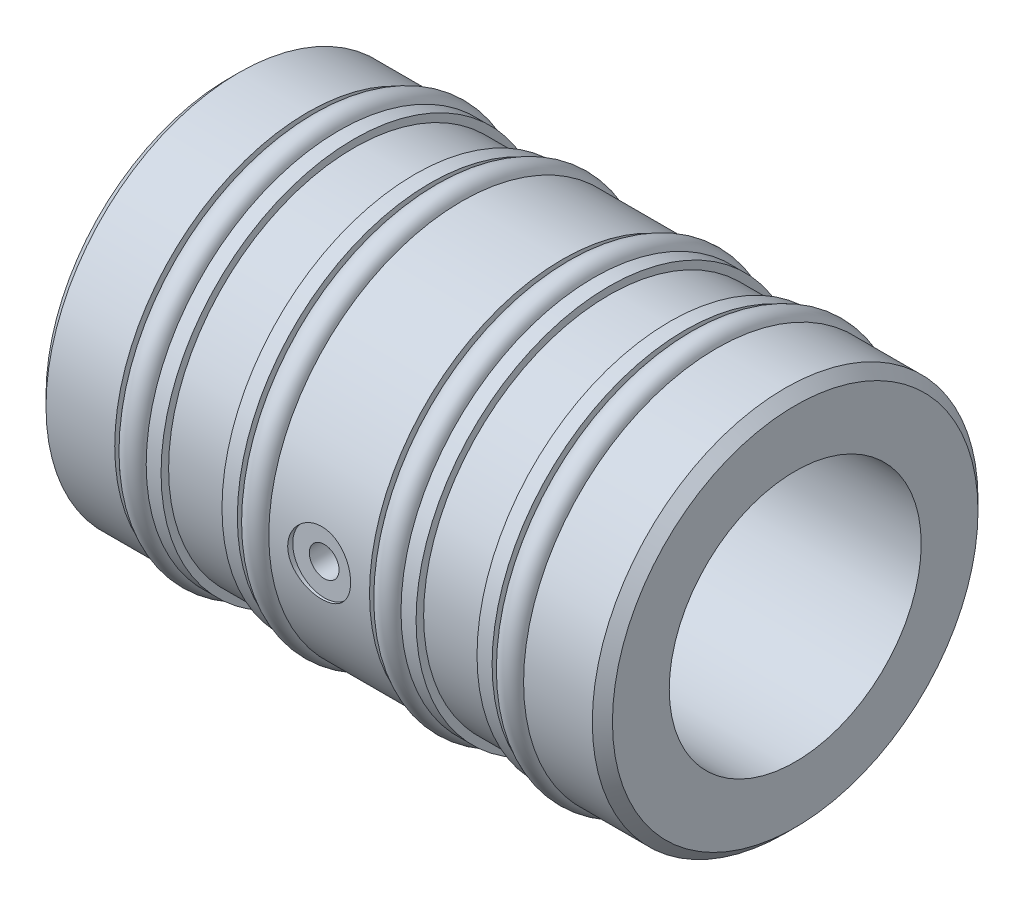
ISO-10303-21;
HEADER;
FILE_DESCRIPTION(('STEP AP214'),'2;1');
FILE_NAME('part.step','',(''),(''),'','','');
FILE_SCHEMA(('AUTOMOTIVE_DESIGN { 1 0 10303 214 1 1 1 1 }'));
ENDSEC;
DATA;
#1=APPLICATION_CONTEXT('core data for automotive mechanical design processes');
#2=APPLICATION_PROTOCOL_DEFINITION('international standard','automotive_design',2000,#1);
#3=PRODUCT_CONTEXT('',#1,'mechanical');
#4=PRODUCT('Part','Part','',(#3));
#5=PRODUCT_RELATED_PRODUCT_CATEGORY('part','',(#4));
#6=PRODUCT_DEFINITION_FORMATION('','',#4);
#7=PRODUCT_DEFINITION_CONTEXT('part definition',#1,'design');
#8=PRODUCT_DEFINITION('design','',#6,#7);
#9=PRODUCT_DEFINITION_SHAPE('','',#8);
#10=(LENGTH_UNIT() NAMED_UNIT(*) SI_UNIT(.MILLI.,.METRE.));
#11=(NAMED_UNIT(*) PLANE_ANGLE_UNIT() SI_UNIT($,.RADIAN.));
#12=(NAMED_UNIT(*) SI_UNIT($,.STERADIAN.) SOLID_ANGLE_UNIT());
#13=UNCERTAINTY_MEASURE_WITH_UNIT(LENGTH_MEASURE(1.E-05),#10,'distance_accuracy_value','');
#14=(GEOMETRIC_REPRESENTATION_CONTEXT(3) GLOBAL_UNCERTAINTY_ASSIGNED_CONTEXT((#13)) GLOBAL_UNIT_ASSIGNED_CONTEXT((#10,
#11,#12)) REPRESENTATION_CONTEXT('',''));
#15=CARTESIAN_POINT('',(0.,0.,0.));
#16=DIRECTION('',(0.,0.,1.));
#17=DIRECTION('',(1.,0.,0.));
#18=AXIS2_PLACEMENT_3D('',#15,#16,#17);
#19=CARTESIAN_POINT('',(0.,0.,0.));
#20=DIRECTION('',(-1.,0.,0.));
#21=DIRECTION('',(0.,0.,1.));
#22=AXIS2_PLACEMENT_3D('',#19,#20,#21);
#23=CYLINDRICAL_SURFACE('',#22,17.4752);
#24=CARTESIAN_POINT('',(46.0248,0.,0.));
#25=DIRECTION('',(-1.,0.,0.));
#26=DIRECTION('',(0.,0.,1.));
#27=AXIS2_PLACEMENT_3D('',#24,#25,#26);
#28=CIRCLE('',#27,17.4752);
#29=CARTESIAN_POINT('',(46.0248,0.,17.4752));
#30=VERTEX_POINT('',#29);
#31=EDGE_CURVE('E320',#30,#30,#28,.T.);
#32=ORIENTED_EDGE('',*,*,#31,.F.);
#33=EDGE_LOOP('',(#32));
#34=FACE_BOUND('',#33,.T.);
#35=CARTESIAN_POINT('',(47.5310200000001,0.,0.));
#36=DIRECTION('',(1.,0.,0.));
#37=DIRECTION('',(0.,0.,-1.));
#38=AXIS2_PLACEMENT_3D('',#35,#36,#37);
#39=CIRCLE('',#38,17.4752);
#40=CARTESIAN_POINT('',(47.5310200000001,0.,-17.4752));
#41=VERTEX_POINT('',#40);
#42=EDGE_CURVE('E14',#41,#41,#39,.T.);
#43=ORIENTED_EDGE('',*,*,#42,.F.);
#44=EDGE_LOOP('',(#43));
#45=FACE_BOUND('',#44,.T.);
#46=ADVANCED_FACE('F48',(#34,#45),#23,.T.);
#47=CARTESIAN_POINT('',(49.1998,0.,0.));
#48=DIRECTION('',(-1.,0.,0.));
#49=DIRECTION('',(0.,0.,1.));
#50=AXIS2_PLACEMENT_3D('',#47,#48,#49);
#51=CIRCLE('',#50,17.4752);
#52=CARTESIAN_POINT('',(49.1998,0.,17.4752));
#53=VERTEX_POINT('',#52);
#54=EDGE_CURVE('E319',#53,#53,#51,.T.);
#55=ORIENTED_EDGE('',*,*,#54,.T.);
#56=EDGE_LOOP('',(#55));
#57=FACE_BOUND('',#56,.T.);
#58=CARTESIAN_POINT('',(47.6935799999999,0.,0.));
#59=DIRECTION('',(-1.,0.,0.));
#60=DIRECTION('',(0.,0.,1.));
#61=AXIS2_PLACEMENT_3D('',#58,#59,#60);
#62=CIRCLE('',#61,17.4752);
#63=CARTESIAN_POINT('',(47.6935799999999,0.,17.4752));
#64=VERTEX_POINT('',#63);
#65=EDGE_CURVE('E56',#64,#64,#62,.T.);
#66=ORIENTED_EDGE('',*,*,#65,.F.);
#67=EDGE_LOOP('',(#66));
#68=FACE_BOUND('',#67,.T.);
#69=ADVANCED_FACE('F117',(#57,#68),#23,.T.);
#70=CARTESIAN_POINT('',(0.,0.,0.));
#71=DIRECTION('',(-1.,0.,0.));
#72=DIRECTION('',(0.,0.,1.));
#73=AXIS2_PLACEMENT_3D('',#70,#71,#72);
#74=CYLINDRICAL_SURFACE('',#73,17.4752);
#75=CARTESIAN_POINT('',(33.655,0.,0.));
#76=DIRECTION('',(-1.,0.,0.));
#77=DIRECTION('',(0.,0.,1.));
#78=AXIS2_PLACEMENT_3D('',#75,#76,#77);
#79=CIRCLE('',#78,17.4752);
#80=CARTESIAN_POINT('',(33.655,0.,17.4752));
#81=VERTEX_POINT('',#80);
#82=EDGE_CURVE('E163',#81,#81,#79,.T.);
#83=ORIENTED_EDGE('',*,*,#82,.F.);
#84=EDGE_LOOP('',(#83));
#85=FACE_BOUND('',#84,.T.);
#86=CARTESIAN_POINT('',(35.1612200000001,0.,0.));
#87=DIRECTION('',(1.,0.,0.));
#88=DIRECTION('',(0.,0.,-1.));
#89=AXIS2_PLACEMENT_3D('',#86,#87,#88);
#90=CIRCLE('',#89,17.4752);
#91=CARTESIAN_POINT('',(35.1612200000001,0.,-17.4752));
#92=VERTEX_POINT('',#91);
#93=EDGE_CURVE('E305',#92,#92,#90,.T.);
#94=ORIENTED_EDGE('',*,*,#93,.F.);
#95=EDGE_LOOP('',(#94));
#96=FACE_BOUND('',#95,.T.);
#97=ADVANCED_FACE('F147',(#85,#96),#74,.T.);
#98=CARTESIAN_POINT('',(36.83,0.,0.));
#99=DIRECTION('',(-1.,0.,0.));
#100=DIRECTION('',(0.,0.,1.));
#101=AXIS2_PLACEMENT_3D('',#98,#99,#100);
#102=CIRCLE('',#101,17.4752);
#103=CARTESIAN_POINT('',(36.83,0.,17.4752));
#104=VERTEX_POINT('',#103);
#105=EDGE_CURVE('E164',#104,#104,#102,.T.);
#106=ORIENTED_EDGE('',*,*,#105,.T.);
#107=EDGE_LOOP('',(#106));
#108=FACE_BOUND('',#107,.T.);
#109=CARTESIAN_POINT('',(35.3237799999999,0.,0.));
#110=DIRECTION('',(-1.,0.,0.));
#111=DIRECTION('',(0.,0.,1.));
#112=AXIS2_PLACEMENT_3D('',#109,#110,#111);
#113=CIRCLE('',#112,17.4752);
#114=CARTESIAN_POINT('',(35.3237799999999,0.,17.4752));
#115=VERTEX_POINT('',#114);
#116=EDGE_CURVE('E298',#115,#115,#113,.T.);
#117=ORIENTED_EDGE('',*,*,#116,.F.);
#118=EDGE_LOOP('',(#117));
#119=FACE_BOUND('',#118,.T.);
#120=ADVANCED_FACE('F149',(#108,#119),#74,.T.);
#121=CARTESIAN_POINT('',(0.,0.,0.));
#122=DIRECTION('',(-1.,0.,0.));
#123=DIRECTION('',(0.,0.,1.));
#124=AXIS2_PLACEMENT_3D('',#121,#122,#123);
#125=CYLINDRICAL_SURFACE('',#124,17.4752);
#126=CARTESIAN_POINT('',(20.32,0.,0.));
#127=DIRECTION('',(-1.,0.,0.));
#128=DIRECTION('',(0.,0.,1.));
#129=AXIS2_PLACEMENT_3D('',#126,#127,#128);
#130=CIRCLE('',#129,17.4752);
#131=CARTESIAN_POINT('',(20.32,0.,17.4752));
#132=VERTEX_POINT('',#131);
#133=EDGE_CURVE('E178',#132,#132,#130,.T.);
#134=ORIENTED_EDGE('',*,*,#133,.F.);
#135=EDGE_LOOP('',(#134));
#136=FACE_BOUND('',#135,.T.);
#137=CARTESIAN_POINT('',(21.8262200000001,0.,0.));
#138=DIRECTION('',(1.,0.,0.));
#139=DIRECTION('',(0.,0.,-1.));
#140=AXIS2_PLACEMENT_3D('',#137,#138,#139);
#141=CIRCLE('',#140,17.4752);
#142=CARTESIAN_POINT('',(21.8262200000001,0.,-17.4752));
#143=VERTEX_POINT('',#142);
#144=EDGE_CURVE('E295',#143,#143,#141,.T.);
#145=ORIENTED_EDGE('',*,*,#144,.F.);
#146=EDGE_LOOP('',(#145));
#147=FACE_BOUND('',#146,.T.);
#148=ADVANCED_FACE('F277',(#136,#147),#125,.T.);
#149=CARTESIAN_POINT('',(23.495,0.,0.));
#150=DIRECTION('',(-1.,0.,0.));
#151=DIRECTION('',(0.,0.,1.));
#152=AXIS2_PLACEMENT_3D('',#149,#150,#151);
#153=CIRCLE('',#152,17.4752);
#154=CARTESIAN_POINT('',(23.495,0.,17.4752));
#155=VERTEX_POINT('',#154);
#156=EDGE_CURVE('E175',#155,#155,#153,.T.);
#157=ORIENTED_EDGE('',*,*,#156,.T.);
#158=EDGE_LOOP('',(#157));
#159=FACE_BOUND('',#158,.T.);
#160=CARTESIAN_POINT('',(21.9887799999999,0.,0.));
#161=DIRECTION('',(-1.,0.,0.));
#162=DIRECTION('',(0.,0.,1.));
#163=AXIS2_PLACEMENT_3D('',#160,#161,#162);
#164=CIRCLE('',#163,17.4752);
#165=CARTESIAN_POINT('',(21.9887799999999,0.,17.4752));
#166=VERTEX_POINT('',#165);
#167=EDGE_CURVE('E293',#166,#166,#164,.T.);
#168=ORIENTED_EDGE('',*,*,#167,.F.);
#169=EDGE_LOOP('',(#168));
#170=FACE_BOUND('',#169,.T.);
#171=ADVANCED_FACE('F248',(#159,#170),#125,.T.);
#172=CARTESIAN_POINT('',(0.,0.,0.));
#173=DIRECTION('',(-1.,0.,0.));
#174=DIRECTION('',(0.,0.,1.));
#175=AXIS2_PLACEMENT_3D('',#172,#173,#174);
#176=CYLINDRICAL_SURFACE('',#175,17.4752);
#177=CARTESIAN_POINT('',(7.9502,0.,0.));
#178=DIRECTION('',(-1.,0.,0.));
#179=DIRECTION('',(0.,0.,1.));
#180=AXIS2_PLACEMENT_3D('',#177,#178,#179);
#181=CIRCLE('',#180,17.4752);
#182=CARTESIAN_POINT('',(7.9502,0.,17.4752));
#183=VERTEX_POINT('',#182);
#184=EDGE_CURVE('E202',#183,#183,#181,.T.);
#185=ORIENTED_EDGE('',*,*,#184,.F.);
#186=EDGE_LOOP('',(#185));
#187=FACE_BOUND('',#186,.T.);
#188=CARTESIAN_POINT('',(9.45642000000007,0.,0.));
#189=DIRECTION('',(1.,0.,0.));
#190=DIRECTION('',(0.,0.,-1.));
#191=AXIS2_PLACEMENT_3D('',#188,#189,#190);
#192=CIRCLE('',#191,17.4752);
#193=CARTESIAN_POINT('',(9.45642000000007,0.,-17.4752));
#194=VERTEX_POINT('',#193);
#195=EDGE_CURVE('E73',#194,#194,#192,.T.);
#196=ORIENTED_EDGE('',*,*,#195,.F.);
#197=EDGE_LOOP('',(#196));
#198=FACE_BOUND('',#197,.T.);
#199=ADVANCED_FACE('F245',(#187,#198),#176,.T.);
#200=CARTESIAN_POINT('',(11.1252,0.,0.));
#201=DIRECTION('',(-1.,0.,0.));
#202=DIRECTION('',(0.,0.,1.));
#203=AXIS2_PLACEMENT_3D('',#200,#201,#202);
#204=CIRCLE('',#203,17.4752);
#205=CARTESIAN_POINT('',(11.1252,0.,17.4752));
#206=VERTEX_POINT('',#205);
#207=EDGE_CURVE('E199',#206,#206,#204,.T.);
#208=ORIENTED_EDGE('',*,*,#207,.T.);
#209=EDGE_LOOP('',(#208));
#210=FACE_BOUND('',#209,.T.);
#211=CARTESIAN_POINT('',(9.61897999999994,0.,0.));
#212=DIRECTION('',(-1.,0.,0.));
#213=DIRECTION('',(0.,0.,1.));
#214=AXIS2_PLACEMENT_3D('',#211,#212,#213);
#215=CIRCLE('',#214,17.4752);
#216=CARTESIAN_POINT('',(9.61897999999994,0.,17.4752));
#217=VERTEX_POINT('',#216);
#218=EDGE_CURVE('E71',#217,#217,#215,.T.);
#219=ORIENTED_EDGE('',*,*,#218,.F.);
#220=EDGE_LOOP('',(#219));
#221=FACE_BOUND('',#220,.T.);
#222=ADVANCED_FACE('F235',(#210,#221),#176,.T.);
#223=CARTESIAN_POINT('',(0.,12.71016,0.));
#224=DIRECTION('',(1.,0.,0.));
#225=DIRECTION('',(0.,0.,-1.));
#226=AXIS2_PLACEMENT_3D('',#223,#224,#225);
#227=PLANE('',#226);
#228=CARTESIAN_POINT('',(0.,0.,0.));
#229=DIRECTION('',(1.,0.,0.));
#230=DIRECTION('',(0.,0.,-1.));
#231=AXIS2_PLACEMENT_3D('',#228,#229,#230);
#232=CIRCLE('',#231,18.4404);
#233=CARTESIAN_POINT('',(0.,0.,-18.4404));
#234=VERTEX_POINT('',#233);
#235=EDGE_CURVE('E208',#234,#234,#232,.F.);
#236=ORIENTED_EDGE('',*,*,#235,.T.);
#237=EDGE_LOOP('',(#236));
#238=FACE_BOUND('',#237,.T.);
#239=CARTESIAN_POINT('',(0.,0.,0.));
#240=DIRECTION('',(-1.,0.,0.));
#241=DIRECTION('',(0.,0.,1.));
#242=AXIS2_PLACEMENT_3D('',#239,#240,#241);
#243=CIRCLE('',#242,12.71016);
#244=CARTESIAN_POINT('',(0.,0.,12.71016));
#245=VERTEX_POINT('',#244);
#246=EDGE_CURVE('E406',#245,#245,#243,.T.);
#247=ORIENTED_EDGE('',*,*,#246,.F.);
#248=EDGE_LOOP('',(#247));
#249=FACE_BOUND('',#248,.T.);
#250=ADVANCED_FACE('F231',(#238,#249),#227,.F.);
#251=CARTESIAN_POINT('',(0.,0.,0.));
#252=DIRECTION('',(-1.,0.,0.));
#253=DIRECTION('',(0.,0.,1.));
#254=AXIS2_PLACEMENT_3D('',#251,#252,#253);
#255=CYLINDRICAL_SURFACE('',#254,19.4564);
#256=CARTESIAN_POINT('',(1.01600000000001,0.,0.));
#257=DIRECTION('',(1.,0.,0.));
#258=DIRECTION('',(0.,0.,-1.));
#259=AXIS2_PLACEMENT_3D('',#256,#257,#258);
#260=CIRCLE('',#259,19.4564);
#261=CARTESIAN_POINT('',(1.01600000000001,0.,-19.4564));
#262=VERTEX_POINT('',#261);
#263=EDGE_CURVE('E211',#262,#262,#260,.T.);
#264=ORIENTED_EDGE('',*,*,#263,.T.);
#265=EDGE_LOOP('',(#264));
#266=FACE_BOUND('',#265,.T.);
#267=CARTESIAN_POINT('',(7.9502,0.,0.));
#268=DIRECTION('',(-1.,0.,0.));
#269=DIRECTION('',(0.,0.,1.));
#270=AXIS2_PLACEMENT_3D('',#267,#268,#269);
#271=CIRCLE('',#270,19.4564);
#272=CARTESIAN_POINT('',(7.9502,0.,19.4564));
#273=VERTEX_POINT('',#272);
#274=EDGE_CURVE('E205',#273,#273,#271,.T.);
#275=ORIENTED_EDGE('',*,*,#274,.T.);
#276=EDGE_LOOP('',(#275));
#277=FACE_BOUND('',#276,.T.);
#278=ADVANCED_FACE('F234',(#266,#277),#255,.T.);
#279=CARTESIAN_POINT('',(7.9502,19.4564,0.));
#280=DIRECTION('',(-1.,0.,0.));
#281=DIRECTION('',(0.,0.,1.));
#282=AXIS2_PLACEMENT_3D('',#279,#280,#281);
#283=PLANE('',#282);
#284=ORIENTED_EDGE('',*,*,#274,.F.);
#285=EDGE_LOOP('',(#284));
#286=FACE_BOUND('',#285,.T.);
#287=ORIENTED_EDGE('',*,*,#184,.T.);
#288=EDGE_LOOP('',(#287));
#289=FACE_BOUND('',#288,.T.);
#290=ADVANCED_FACE('F239',(#286,#289),#283,.F.);
#291=CARTESIAN_POINT('',(11.1252,17.4752,0.));
#292=DIRECTION('',(1.,0.,0.));
#293=DIRECTION('',(0.,0.,-1.));
#294=AXIS2_PLACEMENT_3D('',#291,#292,#293);
#295=PLANE('',#294);
#296=ORIENTED_EDGE('',*,*,#207,.F.);
#297=EDGE_LOOP('',(#296));
#298=FACE_BOUND('',#297,.T.);
#299=CARTESIAN_POINT('',(11.1252,0.,0.));
#300=DIRECTION('',(-1.,0.,0.));
#301=DIRECTION('',(0.,0.,1.));
#302=AXIS2_PLACEMENT_3D('',#299,#300,#301);
#303=CIRCLE('',#302,19.4564);
#304=CARTESIAN_POINT('',(11.1252,0.,19.4564));
#305=VERTEX_POINT('',#304);
#306=EDGE_CURVE('E196',#305,#305,#303,.T.);
#307=ORIENTED_EDGE('',*,*,#306,.T.);
#308=EDGE_LOOP('',(#307));
#309=FACE_BOUND('',#308,.T.);
#310=ADVANCED_FACE('F243',(#298,#309),#295,.F.);
#311=CARTESIAN_POINT('',(0.,0.,0.));
#312=DIRECTION('',(-1.,0.,0.));
#313=DIRECTION('',(0.,0.,1.));
#314=AXIS2_PLACEMENT_3D('',#311,#312,#313);
#315=CYLINDRICAL_SURFACE('',#314,19.4564);
#316=ORIENTED_EDGE('',*,*,#306,.F.);
#317=EDGE_LOOP('',(#316));
#318=FACE_BOUND('',#317,.T.);
#319=CARTESIAN_POINT('',(12.6238,0.,0.));
#320=DIRECTION('',(-1.,0.,0.));
#321=DIRECTION('',(0.,0.,1.));
#322=AXIS2_PLACEMENT_3D('',#319,#320,#321);
#323=CIRCLE('',#322,19.4564);
#324=CARTESIAN_POINT('',(12.6238,0.,19.4564));
#325=VERTEX_POINT('',#324);
#326=EDGE_CURVE('E193',#325,#325,#323,.T.);
#327=ORIENTED_EDGE('',*,*,#326,.T.);
#328=EDGE_LOOP('',(#327));
#329=FACE_BOUND('',#328,.T.);
#330=ADVANCED_FACE('F252',(#318,#329),#315,.T.);
#331=CARTESIAN_POINT('',(12.6238,19.4564,0.));
#332=DIRECTION('',(-1.,0.,0.));
#333=DIRECTION('',(0.,0.,1.));
#334=AXIS2_PLACEMENT_3D('',#331,#332,#333);
#335=PLANE('',#334);
#336=ORIENTED_EDGE('',*,*,#326,.F.);
#337=EDGE_LOOP('',(#336));
#338=FACE_BOUND('',#337,.T.);
#339=CARTESIAN_POINT('',(12.6238,0.,0.));
#340=DIRECTION('',(-1.,0.,0.));
#341=DIRECTION('',(0.,0.,1.));
#342=AXIS2_PLACEMENT_3D('',#339,#340,#341);
#343=CIRCLE('',#342,18.6944);
#344=CARTESIAN_POINT('',(12.6238,0.,18.6944));
#345=VERTEX_POINT('',#344);
#346=EDGE_CURVE('E190',#345,#345,#343,.T.);
#347=ORIENTED_EDGE('',*,*,#346,.T.);
#348=EDGE_LOOP('',(#347));
#349=FACE_BOUND('',#348,.T.);
#350=ADVANCED_FACE('F256',(#338,#349),#335,.F.);
#351=CARTESIAN_POINT('',(0.,0.,0.));
#352=DIRECTION('',(-1.,0.,0.));
#353=DIRECTION('',(0.,0.,1.));
#354=AXIS2_PLACEMENT_3D('',#351,#352,#353);
#355=CYLINDRICAL_SURFACE('',#354,18.6944);
#356=ORIENTED_EDGE('',*,*,#346,.F.);
#357=EDGE_LOOP('',(#356));
#358=FACE_BOUND('',#357,.T.);
#359=CARTESIAN_POINT('',(18.7706,0.,0.));
#360=DIRECTION('',(-1.,0.,0.));
#361=DIRECTION('',(0.,0.,1.));
#362=AXIS2_PLACEMENT_3D('',#359,#360,#361);
#363=CIRCLE('',#362,18.6944);
#364=CARTESIAN_POINT('',(18.7706,0.,18.6944));
#365=VERTEX_POINT('',#364);
#366=EDGE_CURVE('E187',#365,#365,#363,.T.);
#367=ORIENTED_EDGE('',*,*,#366,.T.);
#368=EDGE_LOOP('',(#367));
#369=FACE_BOUND('',#368,.T.);
#370=ADVANCED_FACE('F260',(#358,#369),#355,.T.);
#371=CARTESIAN_POINT('',(18.7706,18.6944,0.));
#372=DIRECTION('',(1.,0.,0.));
#373=DIRECTION('',(0.,0.,-1.));
#374=AXIS2_PLACEMENT_3D('',#371,#372,#373);
#375=PLANE('',#374);
#376=ORIENTED_EDGE('',*,*,#366,.F.);
#377=EDGE_LOOP('',(#376));
#378=FACE_BOUND('',#377,.T.);
#379=CARTESIAN_POINT('',(18.7706,0.,0.));
#380=DIRECTION('',(-1.,0.,0.));
#381=DIRECTION('',(0.,0.,1.));
#382=AXIS2_PLACEMENT_3D('',#379,#380,#381);
#383=CIRCLE('',#382,19.4564);
#384=CARTESIAN_POINT('',(18.7706,0.,19.4564));
#385=VERTEX_POINT('',#384);
#386=EDGE_CURVE('E184',#385,#385,#383,.T.);
#387=ORIENTED_EDGE('',*,*,#386,.T.);
#388=EDGE_LOOP('',(#387));
#389=FACE_BOUND('',#388,.T.);
#390=ADVANCED_FACE('F264',(#378,#389),#375,.F.);
#391=CARTESIAN_POINT('',(0.,0.,0.));
#392=DIRECTION('',(-1.,0.,0.));
#393=DIRECTION('',(0.,0.,1.));
#394=AXIS2_PLACEMENT_3D('',#391,#392,#393);
#395=CYLINDRICAL_SURFACE('',#394,19.4564);
#396=ORIENTED_EDGE('',*,*,#386,.F.);
#397=EDGE_LOOP('',(#396));
#398=FACE_BOUND('',#397,.T.);
#399=CARTESIAN_POINT('',(20.32,0.,0.));
#400=DIRECTION('',(-1.,0.,0.));
#401=DIRECTION('',(0.,0.,1.));
#402=AXIS2_PLACEMENT_3D('',#399,#400,#401);
#403=CIRCLE('',#402,19.4564);
#404=CARTESIAN_POINT('',(20.32,0.,19.4564));
#405=VERTEX_POINT('',#404);
#406=EDGE_CURVE('E181',#405,#405,#403,.T.);
#407=ORIENTED_EDGE('',*,*,#406,.T.);
#408=EDGE_LOOP('',(#407));
#409=FACE_BOUND('',#408,.T.);
#410=ADVANCED_FACE('F268',(#398,#409),#395,.T.);
#411=CARTESIAN_POINT('',(20.32,19.4564,0.));
#412=DIRECTION('',(-1.,0.,0.));
#413=DIRECTION('',(0.,0.,1.));
#414=AXIS2_PLACEMENT_3D('',#411,#412,#413);
#415=PLANE('',#414);
#416=ORIENTED_EDGE('',*,*,#406,.F.);
#417=EDGE_LOOP('',(#416));
#418=FACE_BOUND('',#417,.T.);
#419=ORIENTED_EDGE('',*,*,#133,.T.);
#420=EDGE_LOOP('',(#419));
#421=FACE_BOUND('',#420,.T.);
#422=ADVANCED_FACE('F272',(#418,#421),#415,.F.);
#423=CARTESIAN_POINT('',(23.495,17.4752,0.));
#424=DIRECTION('',(1.,0.,0.));
#425=DIRECTION('',(0.,0.,-1.));
#426=AXIS2_PLACEMENT_3D('',#423,#424,#425);
#427=PLANE('',#426);
#428=ORIENTED_EDGE('',*,*,#156,.F.);
#429=EDGE_LOOP('',(#428));
#430=FACE_BOUND('',#429,.T.);
#431=CARTESIAN_POINT('',(23.495,0.,0.));
#432=DIRECTION('',(-1.,0.,0.));
#433=DIRECTION('',(0.,0.,1.));
#434=AXIS2_PLACEMENT_3D('',#431,#432,#433);
#435=CIRCLE('',#434,19.4564);
#436=CARTESIAN_POINT('',(23.495,0.,19.4564));
#437=VERTEX_POINT('',#436);
#438=EDGE_CURVE('E166',#437,#437,#435,.T.);
#439=ORIENTED_EDGE('',*,*,#438,.T.);
#440=EDGE_LOOP('',(#439));
#441=FACE_BOUND('',#440,.T.);
#442=ADVANCED_FACE('F156',(#430,#441),#427,.F.);
#443=CARTESIAN_POINT('',(0.,0.,0.));
#444=DIRECTION('',(-1.,0.,0.));
#445=DIRECTION('',(0.,0.,1.));
#446=AXIS2_PLACEMENT_3D('',#443,#444,#445);
#447=CYLINDRICAL_SURFACE('',#446,19.4564);
#448=CARTESIAN_POINT('',(31.75,0.,19.4564));
#449=CARTESIAN_POINT('',(31.7499928533095,-0.177080248540076,19.4563970030519));
#450=CARTESIAN_POINT('',(31.7351354354906,-0.354258469943336,19.4539572708394));
#451=CARTESIAN_POINT('',(31.6761209289925,-0.703649286531011,19.4444596014055));
#452=CARTESIAN_POINT('',(31.6319365526539,-0.875857101067813,19.4373973631966));
#453=CARTESIAN_POINT('',(31.5156346637148,-1.21020127264191,19.4194471343395));
#454=CARTESIAN_POINT('',(31.4435396251569,-1.37234561135013,19.4085622224129));
#455=CARTESIAN_POINT('',(31.2735209364874,-1.68221437358157,19.3841647651429));
#456=CARTESIAN_POINT('',(31.1756003771481,-1.82994051976294,19.3706525342852));
#457=CARTESIAN_POINT('',(30.9557535689298,-2.10815736317257,19.3423606617609));
#458=CARTESIAN_POINT('',(30.8336366970191,-2.23849648012736,19.3275715190567));
#459=CARTESIAN_POINT('',(30.5692740054787,-2.47693038887138,19.2984657267088));
#460=CARTESIAN_POINT('',(30.4270269414135,-2.5850238044309,19.2841491063438));
#461=CARTESIAN_POINT('',(30.1254053720196,-2.77650166918276,19.2575172972433));
#462=CARTESIAN_POINT('',(29.9659349741038,-2.85973692201538,19.2452143861436));
#463=CARTESIAN_POINT('',(29.6350420959743,-2.99818177003282,19.2241343538394));
#464=CARTESIAN_POINT('',(29.4636203897168,-3.05339317810352,19.2153570045711));
#465=CARTESIAN_POINT('',(29.1152950633956,-3.13374696467309,19.2024162328692));
#466=CARTESIAN_POINT('',(28.9384532220966,-3.15915057495442,19.1982127496803));
#467=CARTESIAN_POINT('',(28.5829708327598,-3.17997745436004,19.1947743671564));
#468=CARTESIAN_POINT('',(28.4043304075919,-3.17540275775616,19.1955391306855));
#469=CARTESIAN_POINT('',(28.05218236849,-3.13661581562501,19.2019142443241));
#470=CARTESIAN_POINT('',(27.8786414994879,-3.10269647948108,19.2074767036201));
#471=CARTESIAN_POINT('',(27.5397474331926,-3.00664252827987,19.2227455281008));
#472=CARTESIAN_POINT('',(27.3743945062999,-2.94450698209209,19.2324520300377));
#473=CARTESIAN_POINT('',(27.0556901020036,-2.79348578020223,19.2549672488522));
#474=CARTESIAN_POINT('',(26.9023975491436,-2.70447796490904,19.2677900793128));
#475=CARTESIAN_POINT('',(26.6128127133609,-2.50232561934336,19.2950832613851));
#476=CARTESIAN_POINT('',(26.4765217483175,-2.38917921980691,19.3095537405483));
#477=CARTESIAN_POINT('',(26.223112932255,-2.14036301369267,19.3387224475512));
#478=CARTESIAN_POINT('',(26.10624188698,-2.00444178039902,19.3534213398294));
#479=CARTESIAN_POINT('',(25.8969294897628,-1.71478597853518,19.3812317337188));
#480=CARTESIAN_POINT('',(25.8044882833941,-1.56105130382536,19.3943432258707));
#481=CARTESIAN_POINT('',(25.6466393017046,-1.23990446391121,19.417519014863));
#482=CARTESIAN_POINT('',(25.5812527289468,-1.07248169400971,19.4275809201139));
#483=CARTESIAN_POINT('',(25.4795949899737,-0.728830188697904,19.4435044692934));
#484=CARTESIAN_POINT('',(25.4433214899833,-0.552602160341919,19.4493664498942));
#485=CARTESIAN_POINT('',(25.4012527542175,-0.198470461989195,19.4561845403453));
#486=CARTESIAN_POINT('',(25.3951185982466,-0.0206080668209007,19.4571952008247));
#487=CARTESIAN_POINT('',(25.4125999659628,0.333603576969452,19.454345987501));
#488=CARTESIAN_POINT('',(25.4362143938651,0.509952881085101,19.4504862930966));
#489=CARTESIAN_POINT('',(25.5122407176711,0.855089974530489,19.438363813242));
#490=CARTESIAN_POINT('',(25.5644854006629,1.02391557304689,19.4301266027222));
#491=CARTESIAN_POINT('',(25.6961113628105,1.35041159861149,19.4101691522092));
#492=CARTESIAN_POINT('',(25.7754941131223,1.50808142034507,19.3984487233952));
#493=CARTESIAN_POINT('',(25.9599231560857,1.80926632945223,19.3726901544557));
#494=CARTESIAN_POINT('',(26.0651818710594,1.95264969774165,19.3586331590502));
#495=CARTESIAN_POINT('',(26.2980819613003,2.21983839235239,19.3298192136545));
#496=CARTESIAN_POINT('',(26.4257248910977,2.34364235779445,19.3150622151027));
#497=CARTESIAN_POINT('',(26.701287752405,2.56940921342302,19.2863358171587));
#498=CARTESIAN_POINT('',(26.8493960961491,2.67114349628216,19.2723756722962));
#499=CARTESIAN_POINT('',(27.1607991415732,2.84828818234031,19.2469944914997));
#500=CARTESIAN_POINT('',(27.3240933763349,2.92369939455183,19.2355733775351));
#501=CARTESIAN_POINT('',(27.6605844656822,3.0457126783556,19.2166323224157));
#502=CARTESIAN_POINT('',(27.8337386315343,3.09242995057703,19.2090968011887));
#503=CARTESIAN_POINT('',(28.185569143955,3.15609268236552,19.198740534744));
#504=CARTESIAN_POINT('',(28.36424503091,3.17304061309944,19.195919398184));
#505=CARTESIAN_POINT('',(28.719765181974,3.17661684470644,19.1953277045647));
#506=CARTESIAN_POINT('',(28.8966058310427,3.16360489242153,19.1974972213539));
#507=CARTESIAN_POINT('',(29.2455461823259,3.10840709595842,19.2065112871468));
#508=CARTESIAN_POINT('',(29.4176458981058,3.06622133526499,19.2133558227724));
#509=CARTESIAN_POINT('',(29.7520885214964,2.95400896779093,19.2309263398163));
#510=CARTESIAN_POINT('',(29.9144416301446,2.88401207493576,19.2416481775589));
#511=CARTESIAN_POINT('',(30.2251583157226,2.71820107381976,19.2657694418365));
#512=CARTESIAN_POINT('',(30.3735212456015,2.62238577223791,19.2791689921274));
#513=CARTESIAN_POINT('',(30.6538659044109,2.40636883478949,19.3073264656059));
#514=CARTESIAN_POINT('',(30.785642040553,2.28590213469627,19.3220981097007));
#515=CARTESIAN_POINT('',(31.0272330592647,2.02456139071372,19.3512248406182));
#516=CARTESIAN_POINT('',(31.1370428600776,1.88368263760799,19.3655798303957));
#517=CARTESIAN_POINT('',(31.3322429396239,1.5844148324811,19.3923652194946));
#518=CARTESIAN_POINT('',(31.4174674240714,1.42591644468736,19.4047823041172));
#519=CARTESIAN_POINT('',(31.5599520134975,1.09671765438035,19.4261631037843));
#520=CARTESIAN_POINT('',(31.6172402121522,0.926029709017139,19.4351302862434));
#521=CARTESIAN_POINT('',(31.6896688701049,0.628879649857424,19.4466244178447));
#522=CARTESIAN_POINT('',(31.7122571740501,0.504223458332503,19.450270834677));
#523=CARTESIAN_POINT('',(31.7424251719635,0.253061505129628,19.4551596773302));
#524=CARTESIAN_POINT('',(31.7500051075992,0.126555773266344,19.4564021418599));
#525=CARTESIAN_POINT('',(31.75,0.,19.4564));
#526=B_SPLINE_CURVE_WITH_KNOTS('',3,(#448,#449,#450,#451,#452,#453,#454,#455,#456,#457,#458,
#459,#460,#461,#462,#463,#464,#465,#466,#467,#468,#469,#470,#471,#472,#473,#474,#475,#476,#477,
#478,#479,#480,#481,#482,#483,#484,#485,#486,#487,#488,#489,#490,#491,#492,#493,#494,#495,#496,
#497,#498,#499,#500,#501,#502,#503,#504,#505,#506,#507,#508,#509,#510,#511,#512,#513,#514,#515,
#516,#517,#518,#519,#520,#521,#522,#523,#524,#525),.UNSPECIFIED.,.T.,.F.,(4,2,2,2,2,2,2,2,2,2,2,
2,2,2,2,2,2,2,2,2,2,2,2,2,2,2,2,2,2,2,2,2,2,2,2,2,2,2,4),(0.,0.530778180444227,1.06205092415042,
1.59289676664977,2.12367910685846,2.65882240653923,3.19399880290012,3.73232554595357,
4.27061745976137,4.80415575597446,5.33765784765171,5.86589533030847,6.39415024598614,
6.92484368798386,7.45557824119282,7.99261303763931,8.52965103411889,9.06710911069738,
9.60452409901812,10.1358817434986,10.667219816071,11.1954872183527,11.723783262579,
12.2565702059423,12.7893941647527,13.3274984905667,13.8655862768411,14.4014993768783,
14.9373679884172,15.4668357023184,15.9963019010831,16.5252039230769,17.0541303949971,
17.5890750079683,18.1241432338401,18.6627396444707,19.200793301555,19.5801361434095,
19.9594728769686),.UNSPECIFIED.);
#527=CARTESIAN_POINT('',(25.4,0.,19.4564));
#528=VERTEX_POINT('',#527);
#529=CARTESIAN_POINT('',(31.75,0.,19.4564));
#530=VERTEX_POINT('',#529);
#531=EDGE_CURVE('E64',#528,#530,#526,.T.);
#532=ORIENTED_EDGE('',*,*,#531,.T.);
#533=EDGE_CURVE('E62',#530,#528,#526,.T.);
#534=ORIENTED_EDGE('',*,*,#533,.T.);
#535=EDGE_LOOP('',(#532,#534));
#536=FACE_BOUND('',#535,.T.);
#537=ORIENTED_EDGE('',*,*,#438,.F.);
#538=EDGE_LOOP('',(#537));
#539=FACE_BOUND('',#538,.T.);
#540=CARTESIAN_POINT('',(33.655,0.,0.));
#541=DIRECTION('',(-1.,0.,0.));
#542=DIRECTION('',(0.,0.,1.));
#543=AXIS2_PLACEMENT_3D('',#540,#541,#542);
#544=CIRCLE('',#543,19.4564);
#545=CARTESIAN_POINT('',(33.655,0.,19.4564));
#546=VERTEX_POINT('',#545);
#547=EDGE_CURVE('E160',#546,#546,#544,.T.);
#548=ORIENTED_EDGE('',*,*,#547,.T.);
#549=EDGE_LOOP('',(#548));
#550=FACE_BOUND('',#549,.T.);
#551=ADVANCED_FACE('F69',(#536,#539,#550),#447,.T.);
#552=CARTESIAN_POINT('',(33.655,19.4564,0.));
#553=DIRECTION('',(-1.,0.,0.));
#554=DIRECTION('',(0.,0.,1.));
#555=AXIS2_PLACEMENT_3D('',#552,#553,#554);
#556=PLANE('',#555);
#557=ORIENTED_EDGE('',*,*,#547,.F.);
#558=EDGE_LOOP('',(#557));
#559=FACE_BOUND('',#558,.T.);
#560=ORIENTED_EDGE('',*,*,#82,.T.);
#561=EDGE_LOOP('',(#560));
#562=FACE_BOUND('',#561,.T.);
#563=ADVANCED_FACE('F145',(#559,#562),#556,.F.);
#564=CARTESIAN_POINT('',(36.83,19.4564,0.));
#565=DIRECTION('',(1.,0.,0.));
#566=DIRECTION('',(0.,0.,-1.));
#567=AXIS2_PLACEMENT_3D('',#564,#565,#566);
#568=PLANE('',#567);
#569=ORIENTED_EDGE('',*,*,#105,.F.);
#570=EDGE_LOOP('',(#569));
#571=FACE_BOUND('',#570,.T.);
#572=CARTESIAN_POINT('',(36.83,0.,0.));
#573=DIRECTION('',(-1.,0.,0.));
#574=DIRECTION('',(0.,0.,1.));
#575=AXIS2_PLACEMENT_3D('',#572,#573,#574);
#576=CIRCLE('',#575,19.4564);
#577=CARTESIAN_POINT('',(36.83,0.,19.4564));
#578=VERTEX_POINT('',#577);
#579=EDGE_CURVE('E169',#578,#578,#576,.T.);
#580=ORIENTED_EDGE('',*,*,#579,.T.);
#581=EDGE_LOOP('',(#580));
#582=FACE_BOUND('',#581,.T.);
#583=ADVANCED_FACE('F141',(#571,#582),#568,.F.);
#584=CARTESIAN_POINT('',(0.,0.,0.));
#585=DIRECTION('',(-1.,0.,0.));
#586=DIRECTION('',(0.,0.,1.));
#587=AXIS2_PLACEMENT_3D('',#584,#585,#586);
#588=CYLINDRICAL_SURFACE('',#587,19.4564);
#589=ORIENTED_EDGE('',*,*,#579,.F.);
#590=EDGE_LOOP('',(#589));
#591=FACE_BOUND('',#590,.T.);
#592=CARTESIAN_POINT('',(38.354,0.,0.));
#593=DIRECTION('',(-1.,0.,0.));
#594=DIRECTION('',(0.,0.,1.));
#595=AXIS2_PLACEMENT_3D('',#592,#593,#594);
#596=CIRCLE('',#595,19.4564);
#597=CARTESIAN_POINT('',(38.354,0.,19.4564));
#598=VERTEX_POINT('',#597);
#599=EDGE_CURVE('E342',#598,#598,#596,.T.);
#600=ORIENTED_EDGE('',*,*,#599,.T.);
#601=EDGE_LOOP('',(#600));
#602=FACE_BOUND('',#601,.T.);
#603=ADVANCED_FACE('F137',(#591,#602),#588,.T.);
#604=CARTESIAN_POINT('',(38.354,18.6944,0.));
#605=DIRECTION('',(-1.,0.,0.));
#606=DIRECTION('',(0.,0.,1.));
#607=AXIS2_PLACEMENT_3D('',#604,#605,#606);
#608=PLANE('',#607);
#609=ORIENTED_EDGE('',*,*,#599,.F.);
#610=EDGE_LOOP('',(#609));
#611=FACE_BOUND('',#610,.T.);
#612=CARTESIAN_POINT('',(38.354,0.,0.));
#613=DIRECTION('',(-1.,0.,0.));
#614=DIRECTION('',(0.,0.,1.));
#615=AXIS2_PLACEMENT_3D('',#612,#613,#614);
#616=CIRCLE('',#615,18.6944);
#617=CARTESIAN_POINT('',(38.354,0.,18.6944));
#618=VERTEX_POINT('',#617);
#619=EDGE_CURVE('E339',#618,#618,#616,.T.);
#620=ORIENTED_EDGE('',*,*,#619,.T.);
#621=EDGE_LOOP('',(#620));
#622=FACE_BOUND('',#621,.T.);
#623=ADVANCED_FACE('F133',(#611,#622),#608,.F.);
#624=CARTESIAN_POINT('',(0.,0.,0.));
#625=DIRECTION('',(-1.,0.,0.));
#626=DIRECTION('',(0.,0.,1.));
#627=AXIS2_PLACEMENT_3D('',#624,#625,#626);
#628=CYLINDRICAL_SURFACE('',#627,18.6944);
#629=ORIENTED_EDGE('',*,*,#619,.F.);
#630=EDGE_LOOP('',(#629));
#631=FACE_BOUND('',#630,.T.);
#632=CARTESIAN_POINT('',(44.5008,0.,0.));
#633=DIRECTION('',(-1.,0.,0.));
#634=DIRECTION('',(0.,0.,1.));
#635=AXIS2_PLACEMENT_3D('',#632,#633,#634);
#636=CIRCLE('',#635,18.6944);
#637=CARTESIAN_POINT('',(44.5008,0.,18.6944));
#638=VERTEX_POINT('',#637);
#639=EDGE_CURVE('E336',#638,#638,#636,.T.);
#640=ORIENTED_EDGE('',*,*,#639,.T.);
#641=EDGE_LOOP('',(#640));
#642=FACE_BOUND('',#641,.T.);
#643=ADVANCED_FACE('F129',(#631,#642),#628,.T.);
#644=CARTESIAN_POINT('',(44.5008,19.4564,0.));
#645=DIRECTION('',(1.,0.,0.));
#646=DIRECTION('',(0.,0.,-1.));
#647=AXIS2_PLACEMENT_3D('',#644,#645,#646);
#648=PLANE('',#647);
#649=ORIENTED_EDGE('',*,*,#639,.F.);
#650=EDGE_LOOP('',(#649));
#651=FACE_BOUND('',#650,.T.);
#652=CARTESIAN_POINT('',(44.5008,0.,0.));
#653=DIRECTION('',(-1.,0.,0.));
#654=DIRECTION('',(0.,0.,1.));
#655=AXIS2_PLACEMENT_3D('',#652,#653,#654);
#656=CIRCLE('',#655,19.4564);
#657=CARTESIAN_POINT('',(44.5008,0.,19.4564));
#658=VERTEX_POINT('',#657);
#659=EDGE_CURVE('E333',#658,#658,#656,.T.);
#660=ORIENTED_EDGE('',*,*,#659,.T.);
#661=EDGE_LOOP('',(#660));
#662=FACE_BOUND('',#661,.T.);
#663=ADVANCED_FACE('F125',(#651,#662),#648,.F.);
#664=CARTESIAN_POINT('',(0.,0.,0.));
#665=DIRECTION('',(-1.,0.,0.));
#666=DIRECTION('',(0.,0.,1.));
#667=AXIS2_PLACEMENT_3D('',#664,#665,#666);
#668=CYLINDRICAL_SURFACE('',#667,19.4564);
#669=ORIENTED_EDGE('',*,*,#659,.F.);
#670=EDGE_LOOP('',(#669));
#671=FACE_BOUND('',#670,.T.);
#672=CARTESIAN_POINT('',(46.0248,0.,0.));
#673=DIRECTION('',(-1.,0.,0.));
#674=DIRECTION('',(0.,0.,1.));
#675=AXIS2_PLACEMENT_3D('',#672,#673,#674);
#676=CIRCLE('',#675,19.4564);
#677=CARTESIAN_POINT('',(46.0248,0.,19.4564));
#678=VERTEX_POINT('',#677);
#679=EDGE_CURVE('E324',#678,#678,#676,.T.);
#680=ORIENTED_EDGE('',*,*,#679,.T.);
#681=EDGE_LOOP('',(#680));
#682=FACE_BOUND('',#681,.T.);
#683=ADVANCED_FACE('F121',(#671,#682),#668,.T.);
#684=CARTESIAN_POINT('',(46.0248,17.4752,0.));
#685=DIRECTION('',(-1.,0.,0.));
#686=DIRECTION('',(0.,0.,1.));
#687=AXIS2_PLACEMENT_3D('',#684,#685,#686);
#688=PLANE('',#687);
#689=ORIENTED_EDGE('',*,*,#679,.F.);
#690=EDGE_LOOP('',(#689));
#691=FACE_BOUND('',#690,.T.);
#692=ORIENTED_EDGE('',*,*,#31,.T.);
#693=EDGE_LOOP('',(#692));
#694=FACE_BOUND('',#693,.T.);
#695=ADVANCED_FACE('F113',(#691,#694),#688,.F.);
#696=CARTESIAN_POINT('',(49.1998,19.4564,0.));
#697=DIRECTION('',(1.,0.,0.));
#698=DIRECTION('',(0.,0.,-1.));
#699=AXIS2_PLACEMENT_3D('',#696,#697,#698);
#700=PLANE('',#699);
#701=ORIENTED_EDGE('',*,*,#54,.F.);
#702=EDGE_LOOP('',(#701));
#703=FACE_BOUND('',#702,.T.);
#704=CARTESIAN_POINT('',(49.1998,0.,0.));
#705=DIRECTION('',(-1.,0.,0.));
#706=DIRECTION('',(0.,0.,1.));
#707=AXIS2_PLACEMENT_3D('',#704,#705,#706);
#708=CIRCLE('',#707,19.4564);
#709=CARTESIAN_POINT('',(49.1998,0.,19.4564));
#710=VERTEX_POINT('',#709);
#711=EDGE_CURVE('E321',#710,#710,#708,.T.);
#712=ORIENTED_EDGE('',*,*,#711,.T.);
#713=EDGE_LOOP('',(#712));
#714=FACE_BOUND('',#713,.T.);
#715=ADVANCED_FACE('F109',(#703,#714),#700,.F.);
#716=CARTESIAN_POINT('',(0.,0.,0.));
#717=DIRECTION('',(-1.,0.,0.));
#718=DIRECTION('',(0.,0.,1.));
#719=AXIS2_PLACEMENT_3D('',#716,#717,#718);
#720=CYLINDRICAL_SURFACE('',#719,19.4564);
#721=CARTESIAN_POINT('',(56.134,0.,0.));
#722=DIRECTION('',(-1.,0.,0.));
#723=DIRECTION('',(0.,0.,1.));
#724=AXIS2_PLACEMENT_3D('',#721,#722,#723);
#725=CIRCLE('',#724,19.4564);
#726=CARTESIAN_POINT('',(56.134,0.,19.4564));
#727=VERTEX_POINT('',#726);
#728=EDGE_CURVE('E213',#727,#727,#725,.T.);
#729=ORIENTED_EDGE('',*,*,#728,.T.);
#730=EDGE_LOOP('',(#729));
#731=FACE_BOUND('',#730,.T.);
#732=ORIENTED_EDGE('',*,*,#711,.F.);
#733=EDGE_LOOP('',(#732));
#734=FACE_BOUND('',#733,.T.);
#735=ADVANCED_FACE('F105',(#731,#734),#720,.T.);
#736=CARTESIAN_POINT('',(57.15,12.71016,0.));
#737=DIRECTION('',(-1.,0.,0.));
#738=DIRECTION('',(0.,0.,1.));
#739=AXIS2_PLACEMENT_3D('',#736,#737,#738);
#740=PLANE('',#739);
#741=CARTESIAN_POINT('',(57.15,0.,0.));
#742=DIRECTION('',(-1.,0.,0.));
#743=DIRECTION('',(0.,0.,1.));
#744=AXIS2_PLACEMENT_3D('',#741,#742,#743);
#745=CIRCLE('',#744,18.4404);
#746=CARTESIAN_POINT('',(57.15,0.,18.4404));
#747=VERTEX_POINT('',#746);
#748=EDGE_CURVE('E67',#747,#747,#745,.F.);
#749=ORIENTED_EDGE('',*,*,#748,.T.);
#750=EDGE_LOOP('',(#749));
#751=FACE_BOUND('',#750,.T.);
#752=CARTESIAN_POINT('',(57.15,0.,0.));
#753=DIRECTION('',(-1.,0.,0.));
#754=DIRECTION('',(0.,0.,1.));
#755=AXIS2_PLACEMENT_3D('',#752,#753,#754);
#756=CIRCLE('',#755,12.71016);
#757=CARTESIAN_POINT('',(57.15,0.,12.71016));
#758=VERTEX_POINT('',#757);
#759=EDGE_CURVE('E327',#758,#758,#756,.T.);
#760=ORIENTED_EDGE('',*,*,#759,.T.);
#761=EDGE_LOOP('',(#760));
#762=FACE_BOUND('',#761,.T.);
#763=ADVANCED_FACE('F101',(#751,#762),#740,.F.);
#764=CARTESIAN_POINT('',(0.,0.,0.));
#765=DIRECTION('',(-1.,0.,0.));
#766=DIRECTION('',(0.,0.,1.));
#767=AXIS2_PLACEMENT_3D('',#764,#765,#766);
#768=CYLINDRICAL_SURFACE('',#767,12.71016);
#769=CARTESIAN_POINT('',(29.8196,0.,12.71016));
#770=CARTESIAN_POINT('',(29.8195969766826,0.0697305876882178,12.7101592124433));
#771=CARTESIAN_POINT('',(29.8137201308864,0.139507461769664,12.7095800650202));
#772=CARTESIAN_POINT('',(29.7903646630507,0.277127247901176,12.7073254203256));
#773=CARTESIAN_POINT('',(29.7728732103837,0.344967934509041,12.7056487106087));
#774=CARTESIAN_POINT('',(29.7268021552324,0.476702510516084,12.7013882394714));
#775=CARTESIAN_POINT('',(29.6982291927336,0.540598736889679,12.6988050213145));
#776=CARTESIAN_POINT('',(29.6308189550532,0.662674220271822,12.6930204957867));
#777=CARTESIAN_POINT('',(29.5919837416827,0.720854622441712,12.6898193126072));
#778=CARTESIAN_POINT('',(29.505007178335,0.830062216543763,12.6831451559173));
#779=CARTESIAN_POINT('',(29.4568375974499,0.881066877340363,12.6796713774281));
#780=CARTESIAN_POINT('',(29.3526198071819,0.97428154337062,12.672850216013));
#781=CARTESIAN_POINT('',(29.296571236112,1.01649114464395,12.6695028388985));
#782=CARTESIAN_POINT('',(29.1780460281784,1.09099687722925,12.6633052006282));
#783=CARTESIAN_POINT('',(29.1155565625745,1.12327269279182,12.6604559632964));
#784=CARTESIAN_POINT('',(28.9860124263453,1.17686493338181,12.6555870886689));
#785=CARTESIAN_POINT('',(28.9189578642014,1.1981816187306,12.6535674316677));
#786=CARTESIAN_POINT('',(28.7824162669303,1.22918387882792,12.6505936022343));
#787=CARTESIAN_POINT('',(28.7129377740231,1.23890674254358,12.6496360145887));
#788=CARTESIAN_POINT('',(28.5733289738111,1.24656062063906,12.6488841179878));
#789=CARTESIAN_POINT('',(28.5031986830225,1.24449193300238,12.6490897796361));
#790=CARTESIAN_POINT('',(28.3645338708729,1.22865217647847,12.6506380277615));
#791=CARTESIAN_POINT('',(28.2959946512426,1.21492179662987,12.651976661108));
#792=CARTESIAN_POINT('',(28.162198151279,1.17621170895319,12.655633843799));
#793=CARTESIAN_POINT('',(28.0969409136497,1.15123185479297,12.6579524058902));
#794=CARTESIAN_POINT('',(27.9714321048296,1.09068690543815,12.6633127513193));
#795=CARTESIAN_POINT('',(27.9111893100035,1.05510373060793,12.6663557681226));
#796=CARTESIAN_POINT('',(27.7975154883272,0.974375212781528,12.6728210954749));
#797=CARTESIAN_POINT('',(27.7440846526647,0.929229601496195,12.6762434166645));
#798=CARTESIAN_POINT('',(27.6453149930429,0.830430342284745,12.6830993543716));
#799=CARTESIAN_POINT('',(27.6000113161356,0.776741549473397,12.6865329575121));
#800=CARTESIAN_POINT('',(27.5190543063361,0.662502069297888,12.6930109058125));
#801=CARTESIAN_POINT('',(27.4834009835999,0.601951374712321,12.6960552505629));
#802=CARTESIAN_POINT('',(27.4227582635272,0.475682754209434,12.7014126071812));
#803=CARTESIAN_POINT('',(27.3977706189879,0.409963981070158,12.7037254988259));
#804=CARTESIAN_POINT('',(27.3591941669903,0.275236065974759,12.7073581026018));
#805=CARTESIAN_POINT('',(27.3456050327136,0.206227018417471,12.7086778432087));
#806=CARTESIAN_POINT('',(27.3302558651209,0.0671818799829294,12.7101717878614));
#807=CARTESIAN_POINT('',(27.3284473251466,-0.00284880789394342,12.7103506892547));
#808=CARTESIAN_POINT('',(27.3365833269658,-0.142216625830991,12.7095553869359));
#809=CARTESIAN_POINT('',(27.3465277166166,-0.211553764857498,12.7085811981507));
#810=CARTESIAN_POINT('',(27.3778470564026,-0.347426482049944,12.7055922094701));
#811=CARTESIAN_POINT('',(27.3991993253511,-0.413967337612067,12.7035794746865));
#812=CARTESIAN_POINT('',(27.4527050214059,-0.542522604079681,12.6987392363102));
#813=CARTESIAN_POINT('',(27.4848586812182,-0.604536917429988,12.695911715164));
#814=CARTESIAN_POINT('',(27.559174946337,-0.722498247311561,12.68974657141));
#815=CARTESIAN_POINT('',(27.6013694567973,-0.778425077737598,12.6864073351041));
#816=CARTESIAN_POINT('',(27.6945238832775,-0.882419627113415,12.6795987315157));
#817=CARTESIAN_POINT('',(27.7454840101108,-0.930487156992355,12.6761293611051));
#818=CARTESIAN_POINT('',(27.8549345925896,-1.01756679236782,12.6694374065637));
#819=CARTESIAN_POINT('',(27.9134504192993,-1.05654708716432,12.6662157150637));
#820=CARTESIAN_POINT('',(28.0362260591255,-1.12412713966521,12.6603973396716));
#821=CARTESIAN_POINT('',(28.1004857964825,-1.15272703425691,12.6578006475378));
#822=CARTESIAN_POINT('',(28.2328155895636,-1.19868106058738,12.6535317722027));
#823=CARTESIAN_POINT('',(28.3008789944946,-1.21605419299099,12.6518580276726));
#824=CARTESIAN_POINT('',(28.4389740341424,-1.2391232144275,12.6496196526823));
#825=CARTESIAN_POINT('',(28.5090056148846,-1.24481942336746,12.649054991837));
#826=CARTESIAN_POINT('',(28.648732896884,-1.24436856501068,12.6490993294471));
#827=CARTESIAN_POINT('',(28.7184287663521,-1.23827146945193,12.6497033757458));
#828=CARTESIAN_POINT('',(28.8558011177094,-1.21451177524573,12.6520065124091));
#829=CARTESIAN_POINT('',(28.9234775972052,-1.19684916289106,12.6537056040715));
#830=CARTESIAN_POINT('',(29.054890183795,-1.15047345222275,12.6580060220504));
#831=CARTESIAN_POINT('',(29.1186267862916,-1.12176174652273,12.6606072346607));
#832=CARTESIAN_POINT('',(29.2403840385626,-1.05410807159232,12.6664190306681));
#833=CARTESIAN_POINT('',(29.2984047280529,-1.01516617345154,12.6696296098305));
#834=CARTESIAN_POINT('',(29.4073392448212,-0.927969800239753,12.676314670824));
#835=CARTESIAN_POINT('',(29.4582232203459,-0.879678108741534,12.6797901724802));
#836=CARTESIAN_POINT('',(29.5511877084299,-0.775226008693009,12.6866041566666));
#837=CARTESIAN_POINT('',(29.5932661065774,-0.719063715632255,12.6899426061331));
#838=CARTESIAN_POINT('',(29.6675045680079,-0.600316380153977,12.6961146906115));
#839=CARTESIAN_POINT('',(29.6996403007372,-0.537716073916192,12.6989470802131));
#840=CARTESIAN_POINT('',(29.7529015277128,-0.408020563006107,12.7037742534626));
#841=CARTESIAN_POINT('',(29.7740394686867,-0.340930537085319,12.705769983499));
#842=CARTESIAN_POINT('',(29.7994191174929,-0.22788210458268,12.7081960440142));
#843=CARTESIAN_POINT('',(29.8069766462753,-0.182646966791552,12.7089291041853));
#844=CARTESIAN_POINT('',(29.8170680709482,-0.0916145455988528,12.7099113399676));
#845=CARTESIAN_POINT('',(29.8196019865046,-0.0458172643986285,12.710160517473));
#846=CARTESIAN_POINT('',(29.8196,0.,12.71016));
#847=B_SPLINE_CURVE_WITH_KNOTS('',3,(#769,#770,#771,#772,#773,#774,#775,#776,#777,#778,#779,
#780,#781,#782,#783,#784,#785,#786,#787,#788,#789,#790,#791,#792,#793,#794,#795,#796,#797,#798,
#799,#800,#801,#802,#803,#804,#805,#806,#807,#808,#809,#810,#811,#812,#813,#814,#815,#816,#817,
#818,#819,#820,#821,#822,#823,#824,#825,#826,#827,#828,#829,#830,#831,#832,#833,#834,#835,#836,
#837,#838,#839,#840,#841,#842,#843,#844,#845,#846),.UNSPECIFIED.,.T.,.F.,(4,2,2,2,2,2,2,2,2,2,2,
2,2,2,2,2,2,2,2,2,2,2,2,2,2,2,2,2,2,2,2,2,2,2,2,2,2,2,4),(0.,0.209024458843304,0.41828021150156,
0.627410772392407,0.836499348309611,1.04623045074313,1.25597118408108,1.46613805431118,
1.67629993204128,1.88578403145674,2.09526283703706,2.304013734464,2.51276734738224,
2.72187896118762,2.93099644272448,3.14099755647213,3.35099889122522,3.56103472431748,
3.77106453504851,3.98022899732883,4.18939075198697,4.39813818965024,4.60689012487137,
4.81631444857596,5.02574380965108,5.23589564317022,5.4460447052969,5.65583716392695,
5.8656238748969,6.07452360424868,6.28342358118464,6.492297237253,6.70116944189673,
6.91089081158228,7.12066248231786,7.3309434947651,7.54098600158704,7.67832840332808,
7.81567026740966),.UNSPECIFIED.);
#848=CARTESIAN_POINT('',(29.8196,0.,12.71016));
#849=VERTEX_POINT('',#848);
#850=EDGE_CURVE('E82',#849,#849,#847,.T.);
#851=ORIENTED_EDGE('',*,*,#850,.T.);
#852=EDGE_LOOP('',(#851));
#853=FACE_BOUND('',#852,.T.);
#854=ORIENTED_EDGE('',*,*,#759,.F.);
#855=EDGE_LOOP('',(#854));
#856=FACE_BOUND('',#855,.T.);
#857=ORIENTED_EDGE('',*,*,#246,.T.);
#858=EDGE_LOOP('',(#857));
#859=FACE_BOUND('',#858,.T.);
#860=ADVANCED_FACE('F96',(#853,#856,#859),#768,.F.);
#861=CARTESIAN_POINT('',(0.,0.,0.));
#862=DIRECTION('',(1.,0.,0.));
#863=DIRECTION('',(0.,0.,-1.));
#864=AXIS2_PLACEMENT_3D('',#861,#862,#863);
#865=CONICAL_SURFACE('',#864,18.4404,0.785398163397447);
#866=ORIENTED_EDGE('',*,*,#263,.F.);
#867=EDGE_LOOP('',(#866));
#868=FACE_BOUND('',#867,.T.);
#869=ORIENTED_EDGE('',*,*,#235,.F.);
#870=EDGE_LOOP('',(#869));
#871=FACE_BOUND('',#870,.T.);
#872=ADVANCED_FACE('F100',(#868,#871),#865,.T.);
#873=CARTESIAN_POINT('',(56.134,0.,0.));
#874=DIRECTION('',(-1.,0.,0.));
#875=DIRECTION('',(0.,0.,1.));
#876=AXIS2_PLACEMENT_3D('',#873,#874,#875);
#877=CONICAL_SURFACE('',#876,19.4564,0.785398163397455);
#878=ORIENTED_EDGE('',*,*,#748,.F.);
#879=EDGE_LOOP('',(#878));
#880=FACE_BOUND('',#879,.T.);
#881=ORIENTED_EDGE('',*,*,#728,.F.);
#882=EDGE_LOOP('',(#881));
#883=FACE_BOUND('',#882,.T.);
#884=ADVANCED_FACE('F50',(#880,#883),#877,.T.);
#885=CARTESIAN_POINT('',(28.575,0.,19.4564));
#886=DIRECTION('',(0.,0.,1.));
#887=DIRECTION('',(1.,0.,0.));
#888=AXIS2_PLACEMENT_3D('',#885,#886,#887);
#889=CYLINDRICAL_SURFACE('',#888,3.175);
#890=CARTESIAN_POINT('',(28.575,0.,18.9484));
#891=DIRECTION('',(0.,0.,1.));
#892=DIRECTION('',(1.,0.,0.));
#893=AXIS2_PLACEMENT_3D('',#890,#891,#892);
#894=CIRCLE('',#893,3.175);
#895=CARTESIAN_POINT('',(31.75,0.,18.9484));
#896=VERTEX_POINT('',#895);
#897=EDGE_CURVE('E399',#896,#896,#894,.T.);
#898=ORIENTED_EDGE('',*,*,#897,.F.);
#899=EDGE_LOOP('',(#898));
#900=FACE_BOUND('',#899,.T.);
#901=ORIENTED_EDGE('',*,*,#531,.F.);
#902=ORIENTED_EDGE('',*,*,#533,.F.);
#903=EDGE_LOOP('',(#901,#902));
#904=FACE_BOUND('',#903,.T.);
#905=ADVANCED_FACE('F65',(#900,#904),#889,.F.);
#906=CARTESIAN_POINT('',(28.575,0.,18.9484));
#907=DIRECTION('',(0.,0.,-1.));
#908=DIRECTION('',(-1.,0.,0.));
#909=AXIS2_PLACEMENT_3D('',#906,#907,#908);
#910=PLANE('',#909);
#911=CARTESIAN_POINT('',(28.575,0.,18.9484));
#912=DIRECTION('',(0.,0.,1.));
#913=DIRECTION('',(1.,0.,0.));
#914=AXIS2_PLACEMENT_3D('',#911,#912,#913);
#915=CIRCLE('',#914,1.4986);
#916=CARTESIAN_POINT('',(30.0736,0.,18.9484));
#917=VERTEX_POINT('',#916);
#918=EDGE_CURVE('E395',#917,#917,#915,.T.);
#919=ORIENTED_EDGE('',*,*,#918,.F.);
#920=EDGE_LOOP('',(#919));
#921=FACE_BOUND('',#920,.T.);
#922=ORIENTED_EDGE('',*,*,#897,.T.);
#923=EDGE_LOOP('',(#922));
#924=FACE_BOUND('',#923,.T.);
#925=ADVANCED_FACE('F93',(#921,#924),#910,.F.);
#926=CARTESIAN_POINT('',(28.575,0.,18.9484));
#927=DIRECTION('',(0.,0.,1.));
#928=DIRECTION('',(1.,0.,0.));
#929=AXIS2_PLACEMENT_3D('',#926,#927,#928);
#930=CYLINDRICAL_SURFACE('',#929,1.2446);
#931=CARTESIAN_POINT('',(28.575,0.,12.954));
#932=DIRECTION('',(0.,0.,1.));
#933=DIRECTION('',(1.,0.,0.));
#934=AXIS2_PLACEMENT_3D('',#931,#932,#933);
#935=CIRCLE('',#934,1.2446);
#936=CARTESIAN_POINT('',(29.8196,0.,12.954));
#937=VERTEX_POINT('',#936);
#938=EDGE_CURVE('E400',#937,#937,#935,.T.);
#939=ORIENTED_EDGE('',*,*,#938,.T.);
#940=EDGE_LOOP('',(#939));
#941=FACE_BOUND('',#940,.T.);
#942=ORIENTED_EDGE('',*,*,#850,.F.);
#943=EDGE_LOOP('',(#942));
#944=FACE_BOUND('',#943,.T.);
#945=ADVANCED_FACE('F377',(#941,#944),#930,.F.);
#946=CARTESIAN_POINT('',(28.575,0.,18.9484));
#947=DIRECTION('',(0.,0.,1.));
#948=DIRECTION('',(1.,0.,0.));
#949=AXIS2_PLACEMENT_3D('',#946,#947,#948);
#950=CYLINDRICAL_SURFACE('',#949,1.4986);
#951=CARTESIAN_POINT('',(28.575,0.,12.954));
#952=DIRECTION('',(0.,0.,1.));
#953=DIRECTION('',(1.,0.,0.));
#954=AXIS2_PLACEMENT_3D('',#951,#952,#953);
#955=CIRCLE('',#954,1.4986);
#956=CARTESIAN_POINT('',(30.0736,0.,12.954));
#957=VERTEX_POINT('',#956);
#958=EDGE_CURVE('E392',#957,#957,#955,.T.);
#959=ORIENTED_EDGE('',*,*,#958,.F.);
#960=EDGE_LOOP('',(#959));
#961=FACE_BOUND('',#960,.T.);
#962=ORIENTED_EDGE('',*,*,#918,.T.);
#963=EDGE_LOOP('',(#962));
#964=FACE_BOUND('',#963,.T.);
#965=ADVANCED_FACE('F381',(#961,#964),#950,.F.);
#966=CARTESIAN_POINT('',(29.8196,0.,12.954));
#967=DIRECTION('',(0.,0.,-1.));
#968=DIRECTION('',(-1.,0.,0.));
#969=AXIS2_PLACEMENT_3D('',#966,#967,#968);
#970=PLANE('',#969);
#971=ORIENTED_EDGE('',*,*,#938,.F.);
#972=EDGE_LOOP('',(#971));
#973=FACE_BOUND('',#972,.T.);
#974=ORIENTED_EDGE('',*,*,#958,.T.);
#975=EDGE_LOOP('',(#974));
#976=FACE_BOUND('',#975,.T.);
#977=ADVANCED_FACE('F375',(#973,#976),#970,.F.);
#978=CARTESIAN_POINT('',(9.5377,0.,0.));
#979=DIRECTION('',(-1.,0.,0.));
#980=DIRECTION('',(0.,0.,1.));
#981=AXIS2_PLACEMENT_3D('',#978,#979,#980);
#982=TOROIDAL_SURFACE('',#981,18.77441,1.30175);
#983=ORIENTED_EDGE('',*,*,#218,.T.);
#984=EDGE_LOOP('',(#983));
#985=FACE_BOUND('',#984,.T.);
#986=ORIENTED_EDGE('',*,*,#195,.T.);
#987=EDGE_LOOP('',(#986));
#988=FACE_BOUND('',#987,.T.);
#989=ADVANCED_FACE('F373',(#985,#988),#982,.T.);
#990=CARTESIAN_POINT('',(21.9075,0.,0.));
#991=DIRECTION('',(-1.,0.,0.));
#992=DIRECTION('',(0.,0.,1.));
#993=AXIS2_PLACEMENT_3D('',#990,#991,#992);
#994=TOROIDAL_SURFACE('',#993,18.77441,1.30175);
#995=ORIENTED_EDGE('',*,*,#167,.T.);
#996=EDGE_LOOP('',(#995));
#997=FACE_BOUND('',#996,.T.);
#998=ORIENTED_EDGE('',*,*,#144,.T.);
#999=EDGE_LOOP('',(#998));
#1000=FACE_BOUND('',#999,.T.);
#1001=ADVANCED_FACE('F367',(#997,#1000),#994,.T.);
#1002=CARTESIAN_POINT('',(35.2425,0.,0.));
#1003=DIRECTION('',(-1.,0.,0.));
#1004=DIRECTION('',(0.,0.,1.));
#1005=AXIS2_PLACEMENT_3D('',#1002,#1003,#1004);
#1006=TOROIDAL_SURFACE('',#1005,18.77441,1.30174999999999);
#1007=ORIENTED_EDGE('',*,*,#116,.T.);
#1008=EDGE_LOOP('',(#1007));
#1009=FACE_BOUND('',#1008,.T.);
#1010=ORIENTED_EDGE('',*,*,#93,.T.);
#1011=EDGE_LOOP('',(#1010));
#1012=FACE_BOUND('',#1011,.T.);
#1013=ADVANCED_FACE('F362',(#1009,#1012),#1006,.T.);
#1014=CARTESIAN_POINT('',(47.6123,0.,0.));
#1015=DIRECTION('',(-1.,0.,0.));
#1016=DIRECTION('',(0.,0.,1.));
#1017=AXIS2_PLACEMENT_3D('',#1014,#1015,#1016);
#1018=TOROIDAL_SURFACE('',#1017,18.77441,1.30174999999999);
#1019=ORIENTED_EDGE('',*,*,#65,.T.);
#1020=EDGE_LOOP('',(#1019));
#1021=FACE_BOUND('',#1020,.T.);
#1022=ORIENTED_EDGE('',*,*,#42,.T.);
#1023=EDGE_LOOP('',(#1022));
#1024=FACE_BOUND('',#1023,.T.);
#1025=ADVANCED_FACE('F310',(#1021,#1024),#1018,.T.);
#1026=CLOSED_SHELL('',(#46,#69,#97,#120,#148,#171,#199,#222,#250,#278,#290,#310,#330,#350,#370,
#390,#410,#422,#442,#551,#563,#583,#603,#623,#643,#663,#683,#695,#715,#735,#763,#860,#872,#884,
#905,#925,#945,#965,#977,#989,#1001,#1013,#1025));
#1027=MANIFOLD_SOLID_BREP('B2',#1026);
#1028=ADVANCED_BREP_SHAPE_REPRESENTATION('',(#18,#1027),#14);
#1029=SHAPE_DEFINITION_REPRESENTATION(#9,#1028);
ENDSEC;
END-ISO-10303-21;
